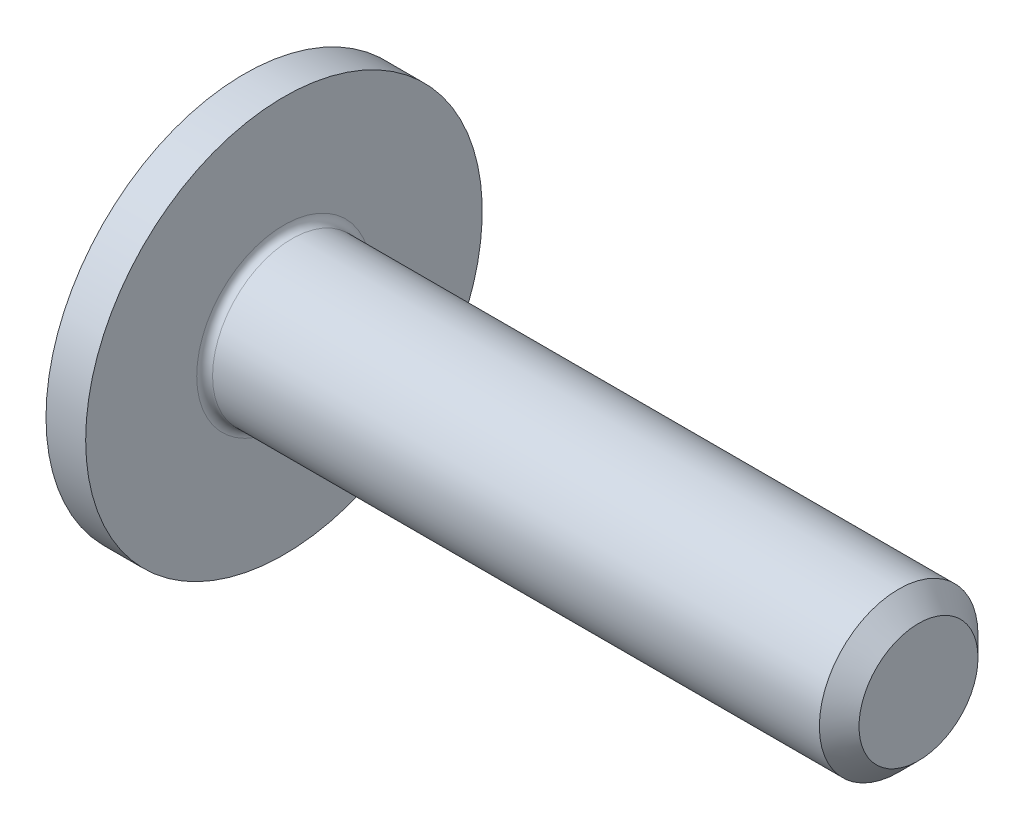
ISO-10303-21;
HEADER;
FILE_DESCRIPTION(('STEP AP214'),'2;1');
FILE_NAME('part.step','',(''),(''),'','','');
FILE_SCHEMA(('AUTOMOTIVE_DESIGN { 1 0 10303 214 1 1 1 1 }'));
ENDSEC;
DATA;
#1=APPLICATION_CONTEXT('core data for automotive mechanical design processes');
#2=APPLICATION_PROTOCOL_DEFINITION('international standard','automotive_design',2000,#1);
#3=PRODUCT_CONTEXT('',#1,'mechanical');
#4=PRODUCT('Part','Part','',(#3));
#5=PRODUCT_RELATED_PRODUCT_CATEGORY('part','',(#4));
#6=PRODUCT_DEFINITION_FORMATION('','',#4);
#7=PRODUCT_DEFINITION_CONTEXT('part definition',#1,'design');
#8=PRODUCT_DEFINITION('design','',#6,#7);
#9=PRODUCT_DEFINITION_SHAPE('','',#8);
#10=(LENGTH_UNIT() NAMED_UNIT(*) SI_UNIT(.MILLI.,.METRE.));
#11=(NAMED_UNIT(*) PLANE_ANGLE_UNIT() SI_UNIT($,.RADIAN.));
#12=(NAMED_UNIT(*) SI_UNIT($,.STERADIAN.) SOLID_ANGLE_UNIT());
#13=UNCERTAINTY_MEASURE_WITH_UNIT(LENGTH_MEASURE(1.E-05),#10,'distance_accuracy_value','');
#14=(GEOMETRIC_REPRESENTATION_CONTEXT(3) GLOBAL_UNCERTAINTY_ASSIGNED_CONTEXT((#13)) GLOBAL_UNIT_ASSIGNED_CONTEXT((#10,
#11,#12)) REPRESENTATION_CONTEXT('',''));
#15=CARTESIAN_POINT('',(0.,0.,0.));
#16=DIRECTION('',(0.,0.,1.));
#17=DIRECTION('',(1.,0.,0.));
#18=AXIS2_PLACEMENT_3D('',#15,#16,#17);
#19=CARTESIAN_POINT('',(5.8,0.,0.));
#20=DIRECTION('',(-1.,0.,0.));
#21=DIRECTION('',(0.,1.,0.));
#22=AXIS2_PLACEMENT_3D('',#19,#20,#21);
#23=SPHERICAL_SURFACE('',#22,5.8);
#24=CARTESIAN_POINT('',(2.05,0.,0.));
#25=DIRECTION('',(1.,0.,0.));
#26=DIRECTION('',(0.,0.,-1.));
#27=AXIS2_PLACEMENT_3D('',#24,#25,#26);
#28=CIRCLE('',#27,4.42464687856557);
#29=CARTESIAN_POINT('',(2.05,0.,-4.42464687856557));
#30=VERTEX_POINT('',#29);
#31=EDGE_CURVE('E423',#30,#30,#28,.F.);
#32=ORIENTED_EDGE('',*,*,#31,.T.);
#33=EDGE_LOOP('',(#32));
#34=FACE_BOUND('',#33,.T.);
#35=CARTESIAN_POINT('',(4.49544161532536,1.48681053180461,1.70147353185102));
#36=DIRECTION('',(0.5,-0.56985204697275,-0.652126248943383));
#37=DIRECTION('',(0.,0.753010530746166,-0.658008465435953));
#38=AXIS2_PLACEMENT_3D('',#35,#36,#37);
#39=CIRCLE('',#38,5.18001058723826);
#40=CARTESIAN_POINT('',(0.350670800180913,1.40442359564326,-1.40442359564326));
#41=VERTEX_POINT('',#40);
#42=CARTESIAN_POINT('',(0.0915426130173634,0.556694252642318,-0.862325791147634));
#43=VERTEX_POINT('',#42);
#44=EDGE_CURVE('E251',#41,#43,#39,.F.);
#45=ORIENTED_EDGE('',*,*,#44,.F.);
#46=CARTESIAN_POINT('',(4.49544161532536,-1.70147353185102,-1.48681053180461));
#47=DIRECTION('',(0.5,0.652126248943383,0.569852046972749));
#48=DIRECTION('',(0.,-0.658008465435952,0.753010530746167));
#49=AXIS2_PLACEMENT_3D('',#46,#47,#48);
#50=CIRCLE('',#49,5.18001058723826);
#51=CARTESIAN_POINT('',(0.0915426130173635,0.862325791147634,-0.556694252642318));
#52=VERTEX_POINT('',#51);
#53=EDGE_CURVE('E247',#52,#41,#50,.F.);
#54=ORIENTED_EDGE('',*,*,#53,.F.);
#55=CARTESIAN_POINT('',(0.0915426130173634,0.,0.));
#56=DIRECTION('',(1.,0.,0.));
#57=DIRECTION('',(0.,0.,-1.));
#58=AXIS2_PLACEMENT_3D('',#55,#56,#57);
#59=CIRCLE('',#58,1.02640842796783);
#60=CARTESIAN_POINT('',(0.0915426130173482,0.891122758840145,-0.509327487654908));
#61=VERTEX_POINT('',#60);
#62=EDGE_CURVE('E244',#61,#52,#59,.F.);
#63=ORIENTED_EDGE('',*,*,#62,.F.);
#64=CARTESIAN_POINT('',(5.80960489391217,0.,-0.155003115548178));
#65=DIRECTION('',(0.0618471864963983,0.,-0.998085630355672));
#66=DIRECTION('',(-0.998085630355672,0.,-0.0618471864963983));
#67=AXIS2_PLACEMENT_3D('',#64,#65,#66);
#68=CIRCLE('',#67,5.79792047032238);
#69=CARTESIAN_POINT('',(0.390286169611535,2.03324772703929,-0.490815600600995));
#70=VERTEX_POINT('',#69);
#71=EDGE_CURVE('E436',#61,#70,#68,.T.);
#72=ORIENTED_EDGE('',*,*,#71,.T.);
#73=CARTESIAN_POINT('',(5.91393656966608,0.380873675740912,0.));
#74=DIRECTION('',(0.286596561114573,0.958051361440137,0.));
#75=DIRECTION('',(-0.958051361440137,0.286596561114573,0.));
#76=AXIS2_PLACEMENT_3D('',#73,#74,#75);
#77=CIRCLE('',#76,5.78635927861555);
#78=CARTESIAN_POINT('',(0.390286169611535,2.03324772703929,0.490815600600995));
#79=VERTEX_POINT('',#78);
#80=EDGE_CURVE('E433',#70,#79,#77,.T.);
#81=ORIENTED_EDGE('',*,*,#80,.T.);
#82=CARTESIAN_POINT('',(5.80960489391217,0.,0.155003115548176));
#83=DIRECTION('',(0.0618471864963987,0.,0.998085630355672));
#84=DIRECTION('',(0.998085630355672,0.,-0.0618471864963988));
#85=AXIS2_PLACEMENT_3D('',#82,#83,#84);
#86=CIRCLE('',#85,5.79792047032238);
#87=CARTESIAN_POINT('',(0.091542613017363,0.891122758839946,0.509327487654907));
#88=VERTEX_POINT('',#87);
#89=EDGE_CURVE('E441',#79,#88,#86,.T.);
#90=ORIENTED_EDGE('',*,*,#89,.T.);
#91=CARTESIAN_POINT('',(0.0915426130173635,0.862325791147634,0.556694252642319));
#92=VERTEX_POINT('',#91);
#93=EDGE_CURVE('E266',#92,#88,#59,.F.);
#94=ORIENTED_EDGE('',*,*,#93,.F.);
#95=CARTESIAN_POINT('',(4.49544161532536,-1.70147353185102,1.48681053180461));
#96=DIRECTION('',(0.5,0.652126248943383,-0.569852046972749));
#97=DIRECTION('',(0.,0.658008465435952,0.753010530746167));
#98=AXIS2_PLACEMENT_3D('',#95,#96,#97);
#99=CIRCLE('',#98,5.18001058723826);
#100=CARTESIAN_POINT('',(0.350670800180913,1.40442359564326,1.40442359564326));
#101=VERTEX_POINT('',#100);
#102=EDGE_CURVE('E252',#101,#92,#99,.F.);
#103=ORIENTED_EDGE('',*,*,#102,.F.);
#104=CARTESIAN_POINT('',(4.49544161532536,1.48681053180461,-1.70147353185102));
#105=DIRECTION('',(0.5,-0.56985204697275,0.652126248943383));
#106=DIRECTION('',(0.,-0.753010530746166,-0.658008465435953));
#107=AXIS2_PLACEMENT_3D('',#104,#105,#106);
#108=CIRCLE('',#107,5.18001058723826);
#109=CARTESIAN_POINT('',(0.0915426130173634,0.556694252642318,0.862325791147634));
#110=VERTEX_POINT('',#109);
#111=EDGE_CURVE('E255',#110,#101,#108,.F.);
#112=ORIENTED_EDGE('',*,*,#111,.F.);
#113=CARTESIAN_POINT('',(0.0915426130173482,0.509327487654905,0.891122758840146));
#114=VERTEX_POINT('',#113);
#115=EDGE_CURVE('E269',#114,#110,#59,.F.);
#116=ORIENTED_EDGE('',*,*,#115,.F.);
#117=CARTESIAN_POINT('',(5.80960489391217,0.155003115548178,0.));
#118=DIRECTION('',(0.0618471864963983,0.998085630355672,0.));
#119=DIRECTION('',(-0.998085630355672,0.0618471864963983,0.));
#120=AXIS2_PLACEMENT_3D('',#117,#118,#119);
#121=CIRCLE('',#120,5.79792047032238);
#122=CARTESIAN_POINT('',(0.390286169611535,0.490815600600988,2.03324772703929));
#123=VERTEX_POINT('',#122);
#124=EDGE_CURVE('E578',#114,#123,#121,.T.);
#125=ORIENTED_EDGE('',*,*,#124,.T.);
#126=CARTESIAN_POINT('',(5.91393656966608,0.,0.380873675740912));
#127=DIRECTION('',(0.286596561114573,0.,0.958051361440137));
#128=DIRECTION('',(0.958051361440137,0.,-0.286596561114573));
#129=AXIS2_PLACEMENT_3D('',#126,#127,#128);
#130=CIRCLE('',#129,5.78635927861555);
#131=CARTESIAN_POINT('',(0.390286169611535,-0.490815600601002,2.03324772703929));
#132=VERTEX_POINT('',#131);
#133=EDGE_CURVE('E447',#123,#132,#130,.T.);
#134=ORIENTED_EDGE('',*,*,#133,.T.);
#135=CARTESIAN_POINT('',(5.80960489391217,-0.155003115548176,0.));
#136=DIRECTION('',(0.0618471864963987,-0.998085630355672,0.));
#137=DIRECTION('',(0.998085630355672,0.0618471864963988,0.));
#138=AXIS2_PLACEMENT_3D('',#135,#136,#137);
#139=CIRCLE('',#138,5.79792047032238);
#140=CARTESIAN_POINT('',(0.0915426130173487,-0.509327487654911,0.891122758840143));
#141=VERTEX_POINT('',#140);
#142=EDGE_CURVE('E577',#132,#141,#139,.T.);
#143=ORIENTED_EDGE('',*,*,#142,.T.);
#144=CARTESIAN_POINT('',(0.0915426130173634,-0.556694252642318,0.862325791147634));
#145=VERTEX_POINT('',#144);
#146=EDGE_CURVE('E615',#145,#141,#59,.F.);
#147=ORIENTED_EDGE('',*,*,#146,.F.);
#148=CARTESIAN_POINT('',(4.49544161532536,-1.48681053180461,-1.70147353185102));
#149=DIRECTION('',(0.5,0.56985204697275,0.652126248943383));
#150=DIRECTION('',(0.,-0.753010530746166,0.658008465435953));
#151=AXIS2_PLACEMENT_3D('',#148,#149,#150);
#152=CIRCLE('',#151,5.18001058723826);
#153=CARTESIAN_POINT('',(0.350670800180913,-1.40442359564326,1.40442359564326));
#154=VERTEX_POINT('',#153);
#155=EDGE_CURVE('E648',#154,#145,#152,.F.);
#156=ORIENTED_EDGE('',*,*,#155,.F.);
#157=CARTESIAN_POINT('',(4.49544161532536,1.70147353185102,1.48681053180461));
#158=DIRECTION('',(0.5,-0.652126248943383,-0.569852046972749));
#159=DIRECTION('',(0.,0.658008465435952,-0.753010530746167));
#160=AXIS2_PLACEMENT_3D('',#157,#158,#159);
#161=CIRCLE('',#160,5.18001058723826);
#162=CARTESIAN_POINT('',(0.0915426130173635,-0.862325791147634,0.556694252642318));
#163=VERTEX_POINT('',#162);
#164=EDGE_CURVE('E657',#163,#154,#161,.F.);
#165=ORIENTED_EDGE('',*,*,#164,.F.);
#166=CARTESIAN_POINT('',(0.091542613017363,-0.891122758839946,0.509327487654907));
#167=VERTEX_POINT('',#166);
#168=EDGE_CURVE('E274',#167,#163,#59,.F.);
#169=ORIENTED_EDGE('',*,*,#168,.F.);
#170=CARTESIAN_POINT('',(0.390286169611531,-2.03324772703928,0.490815600600995));
#171=VERTEX_POINT('',#170);
#172=EDGE_CURVE('E440',#167,#171,#86,.T.);
#173=ORIENTED_EDGE('',*,*,#172,.T.);
#174=CARTESIAN_POINT('',(5.91393656966608,-0.380873675740917,0.));
#175=DIRECTION('',(0.28659656111457,-0.958051361440138,0.));
#176=DIRECTION('',(0.958051361440138,0.28659656111457,0.));
#177=AXIS2_PLACEMENT_3D('',#174,#175,#176);
#178=CIRCLE('',#177,5.78635927861555);
#179=CARTESIAN_POINT('',(0.390286169611531,-2.03324772703928,-0.490815600600995));
#180=VERTEX_POINT('',#179);
#181=EDGE_CURVE('E444',#171,#180,#178,.T.);
#182=ORIENTED_EDGE('',*,*,#181,.T.);
#183=CARTESIAN_POINT('',(0.0915426130173481,-0.891122758840144,-0.509327487654908));
#184=VERTEX_POINT('',#183);
#185=EDGE_CURVE('E437',#180,#184,#68,.T.);
#186=ORIENTED_EDGE('',*,*,#185,.T.);
#187=CARTESIAN_POINT('',(0.0915426130173635,-0.862325791147634,-0.556694252642319));
#188=VERTEX_POINT('',#187);
#189=EDGE_CURVE('E614',#188,#184,#59,.F.);
#190=ORIENTED_EDGE('',*,*,#189,.F.);
#191=CARTESIAN_POINT('',(4.49544161532536,1.70147353185102,-1.48681053180461));
#192=DIRECTION('',(0.5,-0.652126248943383,0.569852046972749));
#193=DIRECTION('',(0.,-0.658008465435952,-0.753010530746167));
#194=AXIS2_PLACEMENT_3D('',#191,#192,#193);
#195=CIRCLE('',#194,5.18001058723826);
#196=CARTESIAN_POINT('',(0.350670800180912,-1.40442359564326,-1.40442359564326));
#197=VERTEX_POINT('',#196);
#198=EDGE_CURVE('E209',#197,#188,#195,.F.);
#199=ORIENTED_EDGE('',*,*,#198,.F.);
#200=CARTESIAN_POINT('',(4.49544161532536,-1.48681053180461,1.70147353185102));
#201=DIRECTION('',(0.5,0.56985204697275,-0.652126248943383));
#202=DIRECTION('',(0.,0.753010530746166,0.658008465435953));
#203=AXIS2_PLACEMENT_3D('',#200,#201,#202);
#204=CIRCLE('',#203,5.18001058723826);
#205=CARTESIAN_POINT('',(0.0915426130173634,-0.556694252642318,-0.862325791147634));
#206=VERTEX_POINT('',#205);
#207=EDGE_CURVE('E219',#206,#197,#204,.F.);
#208=ORIENTED_EDGE('',*,*,#207,.F.);
#209=CARTESIAN_POINT('',(0.0915426130173629,-0.509327487654904,-0.891122758839948));
#210=VERTEX_POINT('',#209);
#211=EDGE_CURVE('E226',#210,#206,#59,.F.);
#212=ORIENTED_EDGE('',*,*,#211,.F.);
#213=CARTESIAN_POINT('',(0.390286169611531,-0.490815600600988,-2.03324772703928));
#214=VERTEX_POINT('',#213);
#215=EDGE_CURVE('E575',#210,#214,#139,.T.);
#216=ORIENTED_EDGE('',*,*,#215,.T.);
#217=CARTESIAN_POINT('',(5.91393656966608,0.,-0.380873675740917));
#218=DIRECTION('',(0.28659656111457,0.,-0.958051361440138));
#219=DIRECTION('',(-0.958051361440138,0.,-0.28659656111457));
#220=AXIS2_PLACEMENT_3D('',#217,#218,#219);
#221=CIRCLE('',#220,5.78635927861555);
#222=CARTESIAN_POINT('',(0.390286169611531,0.490815600601002,-2.03324772703928));
#223=VERTEX_POINT('',#222);
#224=EDGE_CURVE('E449',#214,#223,#221,.T.);
#225=ORIENTED_EDGE('',*,*,#224,.T.);
#226=CARTESIAN_POINT('',(0.0915426130173631,0.50932748765491,-0.891122758839945));
#227=VERTEX_POINT('',#226);
#228=EDGE_CURVE('E579',#223,#227,#121,.T.);
#229=ORIENTED_EDGE('',*,*,#228,.T.);
#230=EDGE_CURVE('E273',#43,#227,#59,.F.);
#231=ORIENTED_EDGE('',*,*,#230,.F.);
#232=EDGE_LOOP('',(#45,#54,#63,#72,#81,#90,#94,#103,#112,#116,#125,#134,#143,#147,#156,#165,
#169,#173,#182,#186,#190,#199,#208,#212,#216,#225,#229,#231));
#233=FACE_BOUND('',#232,.T.);
#234=ADVANCED_FACE('F40',(#34,#233),#23,.T.);
#235=CARTESIAN_POINT('',(2.6,0.,0.));
#236=DIRECTION('',(-1.,0.,0.));
#237=DIRECTION('',(0.,0.,1.));
#238=AXIS2_PLACEMENT_3D('',#235,#236,#237);
#239=CONICAL_SURFACE('',#238,0.850999999999999,0.069813170079766);
#240=CARTESIAN_POINT('',(2.6,0.,0.));
#241=DIRECTION('',(-1.,0.,0.));
#242=DIRECTION('',(0.,0.,1.));
#243=AXIS2_PLACEMENT_3D('',#240,#241,#242);
#244=CIRCLE('',#243,0.850999999999999);
#245=CARTESIAN_POINT('',(2.6,0.,0.850999999999999));
#246=VERTEX_POINT('',#245);
#247=EDGE_CURVE('E260',#246,#246,#244,.T.);
#248=ORIENTED_EDGE('',*,*,#247,.F.);
#249=EDGE_LOOP('',(#248));
#250=FACE_BOUND('',#249,.T.);
#251=CARTESIAN_POINT('',(0.370538725217987,0.0918314341366156,0.0802457051897273));
#252=DIRECTION('',(0.5,0.652126248943383,0.569852046972749));
#253=DIRECTION('',(-0.866025403784438,0.376505265373084,0.329004232717976));
#254=AXIS2_PLACEMENT_3D('',#251,#252,#253);
#255=ELLIPSE('',#254,2.01379823859401,0.999486593679023);
#256=CARTESIAN_POINT('',(0.465382099864509,0.707295596002862,-0.707295596002862));
#257=VERTEX_POINT('',#256);
#258=EDGE_CURVE('E48',#52,#257,#255,.F.);
#259=ORIENTED_EDGE('',*,*,#258,.T.);
#260=CARTESIAN_POINT('',(0.370538725217985,-0.0802457051897277,-0.0918314341366157));
#261=DIRECTION('',(0.5,-0.56985204697275,-0.652126248943383));
#262=DIRECTION('',(-0.866025403784438,-0.329004232717977,-0.376505265373083));
#263=AXIS2_PLACEMENT_3D('',#260,#261,#262);
#264=ELLIPSE('',#263,2.01379823859401,0.999486593679024);
#265=EDGE_CURVE('E11',#257,#43,#264,.F.);
#266=ORIENTED_EDGE('',*,*,#265,.T.);
#267=ORIENTED_EDGE('',*,*,#230,.T.);
#268=CARTESIAN_POINT('',(0.0452078804564265,0.512198656980268,-0.893212462768129));
#269=CARTESIAN_POINT('',(0.365106160426383,0.492375900315463,-0.878790183729411));
#270=CARTESIAN_POINT('',(0.684997245175192,0.472553589508378,-0.864205051965348));
#271=CARTESIAN_POINT('',(1.32476098967625,0.432910109614082,-0.834642123898892));
#272=CARTESIAN_POINT('',(1.64463364944747,0.413088940525694,-0.819664328008124));
#273=CARTESIAN_POINT('',(2.08973198362717,0.385508060843619,-0.798502412906335));
#274=CARTESIAN_POINT('',(2.2149668823717,0.377747778656458,-0.792512888403489));
#275=CARTESIAN_POINT('',(2.3402,0.36998760683761,-0.786486121868666));
#276=B_SPLINE_CURVE_WITH_KNOTS('',3,(#268,#269,#270,#271,#272,#273,#274,#275),.UNSPECIFIED.,.F.,
.F.,(4,2,2,4),(0.,0.962508687501757,1.92501636605824,2.30187028300653),.UNSPECIFIED.);
#277=CARTESIAN_POINT('',(2.34,0.370000000000003,-0.786495747306727));
#278=VERTEX_POINT('',#277);
#279=EDGE_CURVE('E336',#227,#278,#276,.T.);
#280=ORIENTED_EDGE('',*,*,#279,.T.);
#281=CARTESIAN_POINT('',(2.34,0.,0.));
#282=DIRECTION('',(-1.,0.,0.));
#283=DIRECTION('',(0.,0.,1.));
#284=AXIS2_PLACEMENT_3D('',#281,#282,#283);
#285=CIRCLE('',#284,0.86918097110531);
#286=CARTESIAN_POINT('',(2.34,-0.369999999999997,-0.78649574730673));
#287=VERTEX_POINT('',#286);
#288=EDGE_CURVE('E267',#287,#278,#285,.F.);
#289=ORIENTED_EDGE('',*,*,#288,.F.);
#290=CARTESIAN_POINT('',(2.3402,-0.369987606837604,-0.786486121868669));
#291=CARTESIAN_POINT('',(2.07019913746138,-0.386718429516279,-0.799478554072587));
#292=CARTESIAN_POINT('',(1.80019009427807,-0.403449759115245,-0.812299140431048));
#293=CARTESIAN_POINT('',(1.26015794483742,-0.436913289742977,-0.837635105994263));
#294=CARTESIAN_POINT('',(0.990134838591079,-0.453645490771063,-0.850150485434047));
#295=CARTESIAN_POINT('',(0.495143747104779,-0.484318015670855,-0.872848007294731));
#296=CARTESIAN_POINT('',(0.270177625154038,-0.498258224082332,-0.883070947346797));
#297=CARTESIAN_POINT('',(0.0452078804564257,-0.512198656980261,-0.893212462768132));
#298=B_SPLINE_CURVE_WITH_KNOTS('',3,(#290,#291,#292,#293,#294,#295,#296,#297),.UNSPECIFIED.,.F.,
.F.,(4,2,2,4),(0.,0.812491523202115,1.62498242071296,2.30187030608887),.UNSPECIFIED.);
#299=EDGE_CURVE('E341',#287,#210,#298,.T.);
#300=ORIENTED_EDGE('',*,*,#299,.T.);
#301=ORIENTED_EDGE('',*,*,#211,.T.);
#302=CARTESIAN_POINT('',(0.370538725217985,0.0802457051897277,-0.0918314341366157));
#303=DIRECTION('',(0.5,0.56985204697275,-0.652126248943383));
#304=DIRECTION('',(-0.866025403784438,0.329004232717977,-0.376505265373083));
#305=AXIS2_PLACEMENT_3D('',#302,#303,#304);
#306=ELLIPSE('',#305,2.01379823859401,0.999486593679024);
#307=CARTESIAN_POINT('',(0.465382099864508,-0.707295596002862,-0.707295596002861));
#308=VERTEX_POINT('',#307);
#309=EDGE_CURVE('E213',#206,#308,#306,.F.);
#310=ORIENTED_EDGE('',*,*,#309,.T.);
#311=CARTESIAN_POINT('',(0.370538725217986,-0.0918314341366154,0.0802457051897273));
#312=DIRECTION('',(0.5,-0.652126248943383,0.569852046972749));
#313=DIRECTION('',(-0.866025403784438,-0.376505265373084,0.329004232717976));
#314=AXIS2_PLACEMENT_3D('',#311,#312,#313);
#315=ELLIPSE('',#314,2.01379823859401,0.999486593679023);
#316=EDGE_CURVE('E204',#308,#188,#315,.F.);
#317=ORIENTED_EDGE('',*,*,#316,.T.);
#318=ORIENTED_EDGE('',*,*,#189,.T.);
#319=CARTESIAN_POINT('',(0.0452078804564257,-0.89321246276813,-0.512198656980264));
#320=CARTESIAN_POINT('',(0.365106160426382,-0.878790183729412,-0.492375900315459));
#321=CARTESIAN_POINT('',(0.684997245175191,-0.864205051965349,-0.472553589508375));
#322=CARTESIAN_POINT('',(1.32476098967625,-0.834642123898894,-0.432910109614079));
#323=CARTESIAN_POINT('',(1.64463364944747,-0.819664328008126,-0.413088940525692));
#324=CARTESIAN_POINT('',(2.08973198362717,-0.798502412906337,-0.385508060843616));
#325=CARTESIAN_POINT('',(2.2149668823717,-0.792512888403491,-0.377747778656455));
#326=CARTESIAN_POINT('',(2.3402,-0.786486121868667,-0.369987606837608));
#327=B_SPLINE_CURVE_WITH_KNOTS('',3,(#319,#320,#321,#322,#323,#324,#325,#326),.UNSPECIFIED.,.F.,
.F.,(4,2,2,4),(0.,0.962508687501757,1.92501636605824,2.30187028300653),.UNSPECIFIED.);
#328=CARTESIAN_POINT('',(2.34,-0.786495747306728,-0.370000000000001));
#329=VERTEX_POINT('',#328);
#330=EDGE_CURVE('E330',#184,#329,#327,.T.);
#331=ORIENTED_EDGE('',*,*,#330,.T.);
#332=CARTESIAN_POINT('',(2.34,-0.786495747306729,0.37));
#333=VERTEX_POINT('',#332);
#334=EDGE_CURVE('E675',#333,#329,#285,.F.);
#335=ORIENTED_EDGE('',*,*,#334,.F.);
#336=CARTESIAN_POINT('',(2.3402,-0.786486121868668,0.369987606837607));
#337=CARTESIAN_POINT('',(2.07019913746138,-0.799478554072585,0.386718429516281));
#338=CARTESIAN_POINT('',(1.80019009427807,-0.812299140431046,0.403449759115247));
#339=CARTESIAN_POINT('',(1.26015794483742,-0.837635105994262,0.43691328974298));
#340=CARTESIAN_POINT('',(0.990134838591079,-0.850150485434045,0.453645490771066));
#341=CARTESIAN_POINT('',(0.495143747104779,-0.872848007294729,0.484318015670858));
#342=CARTESIAN_POINT('',(0.270177625154038,-0.883070947346795,0.498258224082335));
#343=CARTESIAN_POINT('',(0.0452078804564257,-0.89321246276813,0.512198656980265));
#344=B_SPLINE_CURVE_WITH_KNOTS('',3,(#336,#337,#338,#339,#340,#341,#342,#343),.UNSPECIFIED.,.F.,
.F.,(4,2,2,4),(0.,0.812491523202115,1.62498242071296,2.30187030608887),.UNSPECIFIED.);
#345=EDGE_CURVE('E316',#333,#167,#344,.T.);
#346=ORIENTED_EDGE('',*,*,#345,.T.);
#347=ORIENTED_EDGE('',*,*,#168,.T.);
#348=CARTESIAN_POINT('',(0.370538725217987,-0.0918314341366156,-0.0802457051897273));
#349=DIRECTION('',(0.5,-0.652126248943383,-0.569852046972749));
#350=DIRECTION('',(-0.866025403784438,-0.376505265373084,-0.329004232717976));
#351=AXIS2_PLACEMENT_3D('',#348,#349,#350);
#352=ELLIPSE('',#351,2.01379823859401,0.999486593679023);
#353=CARTESIAN_POINT('',(0.465382099864509,-0.707295596002862,0.707295596002862));
#354=VERTEX_POINT('',#353);
#355=EDGE_CURVE('E227',#163,#354,#352,.F.);
#356=ORIENTED_EDGE('',*,*,#355,.T.);
#357=CARTESIAN_POINT('',(0.370538725217985,0.0802457051897277,0.0918314341366157));
#358=DIRECTION('',(0.5,0.56985204697275,0.652126248943383));
#359=DIRECTION('',(-0.866025403784438,0.329004232717977,0.376505265373083));
#360=AXIS2_PLACEMENT_3D('',#357,#358,#359);
#361=ELLIPSE('',#360,2.01379823859401,0.999486593679024);
#362=EDGE_CURVE('E230',#354,#145,#361,.F.);
#363=ORIENTED_EDGE('',*,*,#362,.T.);
#364=ORIENTED_EDGE('',*,*,#146,.T.);
#365=CARTESIAN_POINT('',(0.0452078804564256,-0.512198656980268,0.893212462768128));
#366=CARTESIAN_POINT('',(0.365106160426382,-0.492375900315462,0.878790183729411));
#367=CARTESIAN_POINT('',(0.684997245175191,-0.472553589508378,0.864205051965348));
#368=CARTESIAN_POINT('',(1.32476098967625,-0.432910109614081,0.834642123898892));
#369=CARTESIAN_POINT('',(1.64463364944747,-0.413088940525694,0.819664328008125));
#370=CARTESIAN_POINT('',(2.08973198362717,-0.385508060843618,0.798502412906336));
#371=CARTESIAN_POINT('',(2.2149668823717,-0.377747778656457,0.79251288840349));
#372=CARTESIAN_POINT('',(2.3402,-0.36998760683761,0.786486121868666));
#373=B_SPLINE_CURVE_WITH_KNOTS('',3,(#365,#366,#367,#368,#369,#370,#371,#372),.UNSPECIFIED.,.F.,
.F.,(4,2,2,4),(0.,0.962508687501757,1.92501636605824,2.30187028300653),.UNSPECIFIED.);
#374=CARTESIAN_POINT('',(2.34,-0.370000000000002,0.786495747306728));
#375=VERTEX_POINT('',#374);
#376=EDGE_CURVE('E272',#141,#375,#373,.T.);
#377=ORIENTED_EDGE('',*,*,#376,.T.);
#378=CARTESIAN_POINT('',(2.34,0.369999999999998,0.78649574730673));
#379=VERTEX_POINT('',#378);
#380=EDGE_CURVE('E263',#379,#375,#285,.F.);
#381=ORIENTED_EDGE('',*,*,#380,.F.);
#382=CARTESIAN_POINT('',(2.3402,0.369987606837605,0.786486121868669));
#383=CARTESIAN_POINT('',(2.07019913746138,0.386718429516279,0.799478554072586));
#384=CARTESIAN_POINT('',(1.80019009427807,0.403449759115245,0.812299140431047));
#385=CARTESIAN_POINT('',(1.26015794483742,0.436913289742977,0.837635105994263));
#386=CARTESIAN_POINT('',(0.990134838591079,0.453645490771063,0.850150485434047));
#387=CARTESIAN_POINT('',(0.495143747104779,0.484318015670855,0.87284800729473));
#388=CARTESIAN_POINT('',(0.270177625154038,0.498258224082332,0.883070947346796));
#389=CARTESIAN_POINT('',(0.0452078804564257,0.512198656980261,0.893212462768132));
#390=B_SPLINE_CURVE_WITH_KNOTS('',3,(#382,#383,#384,#385,#386,#387,#388,#389),.UNSPECIFIED.,.F.,
.F.,(4,2,2,4),(0.,0.812491523202115,1.62498242071296,2.30187030608887),.UNSPECIFIED.);
#391=EDGE_CURVE('E304',#379,#114,#390,.T.);
#392=ORIENTED_EDGE('',*,*,#391,.T.);
#393=ORIENTED_EDGE('',*,*,#115,.T.);
#394=CARTESIAN_POINT('',(0.370538725217985,-0.0802457051897277,0.0918314341366157));
#395=DIRECTION('',(0.5,-0.56985204697275,0.652126248943383));
#396=DIRECTION('',(-0.866025403784438,-0.329004232717977,0.376505265373083));
#397=AXIS2_PLACEMENT_3D('',#394,#395,#396);
#398=ELLIPSE('',#397,2.01379823859401,0.999486593679024);
#399=CARTESIAN_POINT('',(0.465382099864508,0.707295596002861,0.707295596002861));
#400=VERTEX_POINT('',#399);
#401=EDGE_CURVE('E236',#110,#400,#398,.F.);
#402=ORIENTED_EDGE('',*,*,#401,.T.);
#403=CARTESIAN_POINT('',(0.370538725217986,0.0918314341366154,-0.0802457051897273));
#404=DIRECTION('',(0.5,0.652126248943383,-0.569852046972749));
#405=DIRECTION('',(-0.866025403784438,0.376505265373084,-0.329004232717976));
#406=AXIS2_PLACEMENT_3D('',#403,#404,#405);
#407=ELLIPSE('',#406,2.01379823859401,0.999486593679023);
#408=EDGE_CURVE('E239',#400,#92,#407,.F.);
#409=ORIENTED_EDGE('',*,*,#408,.T.);
#410=ORIENTED_EDGE('',*,*,#93,.T.);
#411=CARTESIAN_POINT('',(0.0452078804564257,0.89321246276813,0.512198656980265));
#412=CARTESIAN_POINT('',(0.365106160426382,0.878790183729412,0.492375900315459));
#413=CARTESIAN_POINT('',(0.684997245175191,0.864205051965349,0.472553589508375));
#414=CARTESIAN_POINT('',(1.32476098967625,0.834642123898894,0.432910109614078));
#415=CARTESIAN_POINT('',(1.64463364944747,0.819664328008126,0.413088940525691));
#416=CARTESIAN_POINT('',(2.08973198362717,0.798502412906337,0.385508060843615));
#417=CARTESIAN_POINT('',(2.2149668823717,0.792512888403491,0.377747778656454));
#418=CARTESIAN_POINT('',(2.3402,0.786486121868668,0.369987606837607));
#419=B_SPLINE_CURVE_WITH_KNOTS('',3,(#411,#412,#413,#414,#415,#416,#417,#418),.UNSPECIFIED.,.F.,
.F.,(4,2,2,4),(0.,0.962508687501757,1.92501636605824,2.30187028300653),.UNSPECIFIED.);
#420=CARTESIAN_POINT('',(2.34,0.786495747306729,0.37));
#421=VERTEX_POINT('',#420);
#422=EDGE_CURVE('E282',#88,#421,#419,.T.);
#423=ORIENTED_EDGE('',*,*,#422,.T.);
#424=CARTESIAN_POINT('',(2.34,0.786495747306729,-0.370000000000001));
#425=VERTEX_POINT('',#424);
#426=EDGE_CURVE('E268',#425,#421,#285,.F.);
#427=ORIENTED_EDGE('',*,*,#426,.F.);
#428=CARTESIAN_POINT('',(2.3402,0.786486121868667,-0.369987606837607));
#429=CARTESIAN_POINT('',(2.07019913746138,0.799478554072585,-0.386718429516282));
#430=CARTESIAN_POINT('',(1.80019009427807,0.812299140431046,-0.403449759115248));
#431=CARTESIAN_POINT('',(1.26015794483742,0.837635105994261,-0.43691328974298));
#432=CARTESIAN_POINT('',(0.990134838591079,0.850150485434045,-0.453645490771066));
#433=CARTESIAN_POINT('',(0.495143747104779,0.872848007294729,-0.484318015670858));
#434=CARTESIAN_POINT('',(0.270177625154039,0.883070947346795,-0.498258224082335));
#435=CARTESIAN_POINT('',(0.0452078804564266,0.89321246276813,-0.512198656980264));
#436=B_SPLINE_CURVE_WITH_KNOTS('',3,(#428,#429,#430,#431,#432,#433,#434,#435),.UNSPECIFIED.,.F.,
.F.,(4,2,2,4),(0.,0.812491523202115,1.62498242071296,2.30187030608887),.UNSPECIFIED.);
#437=EDGE_CURVE('E323',#425,#61,#436,.T.);
#438=ORIENTED_EDGE('',*,*,#437,.T.);
#439=ORIENTED_EDGE('',*,*,#62,.T.);
#440=EDGE_LOOP('',(#259,#266,#267,#280,#289,#300,#301,#310,#317,#318,#331,#335,#346,#347,#356,
#363,#364,#377,#381,#392,#393,#402,#409,#410,#423,#427,#438,#439));
#441=FACE_BOUND('',#440,.T.);
#442=ADVANCED_FACE('F224',(#250,#441),#239,.F.);
#443=CARTESIAN_POINT('',(0.,-2.14999999999999,0.515));
#444=DIRECTION('',(0.0618471864963987,0.,0.998085630355672));
#445=DIRECTION('',(0.998085630355672,0.,-0.0618471864963988));
#446=AXIS2_PLACEMENT_3D('',#443,#444,#445);
#447=PLANE('',#446);
#448=ORIENTED_EDGE('',*,*,#345,.F.);
#449=DIRECTION('',(0.,1.,0.));
#450=VECTOR('',#449,1.);
#451=CARTESIAN_POINT('',(2.34,-1.45,0.37));
#452=LINE('',#451,#450);
#453=CARTESIAN_POINT('',(2.34,-1.45,0.37));
#454=VERTEX_POINT('',#453);
#455=EDGE_CURVE('E554',#454,#333,#452,.T.);
#456=ORIENTED_EDGE('',*,*,#455,.F.);
#457=DIRECTION('',(0.956367545721271,0.286092855557643,-0.0592620915083696));
#458=VECTOR('',#457,1.);
#459=CARTESIAN_POINT('',(0.,-2.14999999999999,0.515));
#460=LINE('',#459,#458);
#461=EDGE_CURVE('E548',#171,#454,#460,.T.);
#462=ORIENTED_EDGE('',*,*,#461,.F.);
#463=ORIENTED_EDGE('',*,*,#172,.F.);
#464=EDGE_LOOP('',(#448,#456,#462,#463));
#465=FACE_BOUND('',#464,.T.);
#466=ADVANCED_FACE('F296',(#465),#447,.F.);
#467=CARTESIAN_POINT('',(0.,2.15000000000001,-0.515));
#468=DIRECTION('',(0.0618471864963983,0.,-0.998085630355672));
#469=DIRECTION('',(-0.998085630355672,0.,-0.0618471864963983));
#470=AXIS2_PLACEMENT_3D('',#467,#468,#469);
#471=PLANE('',#470);
#472=ORIENTED_EDGE('',*,*,#330,.F.);
#473=ORIENTED_EDGE('',*,*,#185,.F.);
#474=DIRECTION('',(0.956367545721271,0.286092855557643,0.0592620915083691));
#475=VECTOR('',#474,1.);
#476=CARTESIAN_POINT('',(0.,-2.14999999999999,-0.515));
#477=LINE('',#476,#475);
#478=CARTESIAN_POINT('',(2.34,-1.45,-0.370000000000001));
#479=VERTEX_POINT('',#478);
#480=EDGE_CURVE('E551',#180,#479,#477,.T.);
#481=ORIENTED_EDGE('',*,*,#480,.T.);
#482=DIRECTION('',(0.,-1.,0.));
#483=VECTOR('',#482,1.);
#484=CARTESIAN_POINT('',(2.34,1.45,-0.37));
#485=LINE('',#484,#483);
#486=EDGE_CURVE('E566',#329,#479,#485,.T.);
#487=ORIENTED_EDGE('',*,*,#486,.F.);
#488=EDGE_LOOP('',(#472,#473,#481,#487));
#489=FACE_BOUND('',#488,.T.);
#490=ADVANCED_FACE('F366',(#489),#471,.F.);
#491=ORIENTED_EDGE('',*,*,#422,.F.);
#492=ORIENTED_EDGE('',*,*,#89,.F.);
#493=DIRECTION('',(0.95636754572127,-0.286092855557647,-0.0592620915083695));
#494=VECTOR('',#493,1.);
#495=CARTESIAN_POINT('',(0.,2.15000000000001,0.515));
#496=LINE('',#495,#494);
#497=CARTESIAN_POINT('',(2.34,1.45,0.37));
#498=VERTEX_POINT('',#497);
#499=EDGE_CURVE('E570',#79,#498,#496,.T.);
#500=ORIENTED_EDGE('',*,*,#499,.T.);
#501=EDGE_CURVE('E558',#421,#498,#452,.T.);
#502=ORIENTED_EDGE('',*,*,#501,.F.);
#503=EDGE_LOOP('',(#491,#492,#500,#502));
#504=FACE_BOUND('',#503,.T.);
#505=ADVANCED_FACE('F368',(#504),#447,.F.);
#506=ORIENTED_EDGE('',*,*,#437,.F.);
#507=CARTESIAN_POINT('',(2.34,1.45,-0.37));
#508=VERTEX_POINT('',#507);
#509=EDGE_CURVE('E563',#508,#425,#485,.T.);
#510=ORIENTED_EDGE('',*,*,#509,.F.);
#511=DIRECTION('',(0.95636754572127,-0.286092855557647,0.0592620915083691));
#512=VECTOR('',#511,1.);
#513=CARTESIAN_POINT('',(0.,2.15000000000001,-0.515));
#514=LINE('',#513,#512);
#515=EDGE_CURVE('E562',#70,#508,#514,.T.);
#516=ORIENTED_EDGE('',*,*,#515,.F.);
#517=ORIENTED_EDGE('',*,*,#71,.F.);
#518=EDGE_LOOP('',(#506,#510,#516,#517));
#519=FACE_BOUND('',#518,.T.);
#520=ADVANCED_FACE('F374',(#519),#471,.F.);
#521=CARTESIAN_POINT('',(2.34,1.45,0.37));
#522=DIRECTION('',(-1.,0.,0.));
#523=DIRECTION('',(0.,0.,1.));
#524=AXIS2_PLACEMENT_3D('',#521,#522,#523);
#525=PLANE('',#524);
#526=ORIENTED_EDGE('',*,*,#455,.T.);
#527=ORIENTED_EDGE('',*,*,#334,.T.);
#528=ORIENTED_EDGE('',*,*,#486,.T.);
#529=DIRECTION('',(0.,0.,1.));
#530=VECTOR('',#529,1.);
#531=CARTESIAN_POINT('',(2.34,-1.45,-0.370000000000001));
#532=LINE('',#531,#530);
#533=EDGE_CURVE('E559',#479,#454,#532,.T.);
#534=ORIENTED_EDGE('',*,*,#533,.T.);
#535=EDGE_LOOP('',(#526,#527,#528,#534));
#536=FACE_BOUND('',#535,.T.);
#537=ADVANCED_FACE('F383',(#536),#525,.T.);
#538=DIRECTION('',(0.,0.,1.));
#539=VECTOR('',#538,1.);
#540=CARTESIAN_POINT('',(2.34,-0.369999999999995,-1.45));
#541=LINE('',#540,#539);
#542=CARTESIAN_POINT('',(2.34,-0.369999999999995,-1.45));
#543=VERTEX_POINT('',#542);
#544=EDGE_CURVE('E582',#543,#287,#541,.T.);
#545=ORIENTED_EDGE('',*,*,#544,.T.);
#546=ORIENTED_EDGE('',*,*,#288,.T.);
#547=DIRECTION('',(0.,0.,-1.));
#548=VECTOR('',#547,1.);
#549=CARTESIAN_POINT('',(2.34,0.369999999999995,1.45000000000001));
#550=LINE('',#549,#548);
#551=CARTESIAN_POINT('',(2.34,0.370000000000006,-1.44999999999999));
#552=VERTEX_POINT('',#551);
#553=EDGE_CURVE('E594',#278,#552,#550,.T.);
#554=ORIENTED_EDGE('',*,*,#553,.T.);
#555=DIRECTION('',(0.,-1.,0.));
#556=VECTOR('',#555,1.);
#557=CARTESIAN_POINT('',(2.34,0.370000000000006,-1.44999999999999));
#558=LINE('',#557,#556);
#559=EDGE_CURVE('E587',#552,#543,#558,.T.);
#560=ORIENTED_EDGE('',*,*,#559,.T.);
#561=EDGE_LOOP('',(#545,#546,#554,#560));
#562=FACE_BOUND('',#561,.T.);
#563=ADVANCED_FACE('F610',(#562),#525,.T.);
#564=ORIENTED_EDGE('',*,*,#509,.T.);
#565=ORIENTED_EDGE('',*,*,#426,.T.);
#566=ORIENTED_EDGE('',*,*,#501,.T.);
#567=DIRECTION('',(0.,0.,-1.));
#568=VECTOR('',#567,1.);
#569=CARTESIAN_POINT('',(2.34,1.45,0.37));
#570=LINE('',#569,#568);
#571=EDGE_CURVE('E557',#498,#508,#570,.T.);
#572=ORIENTED_EDGE('',*,*,#571,.T.);
#573=EDGE_LOOP('',(#564,#565,#566,#572));
#574=FACE_BOUND('',#573,.T.);
#575=ADVANCED_FACE('F351',(#574),#525,.T.);
#576=CARTESIAN_POINT('',(0.,0.514999999999992,2.15000000000001));
#577=DIRECTION('',(0.0618471864963983,0.998085630355672,0.));
#578=DIRECTION('',(-0.998085630355672,0.0618471864963983,0.));
#579=AXIS2_PLACEMENT_3D('',#576,#577,#578);
#580=PLANE('',#579);
#581=ORIENTED_EDGE('',*,*,#279,.F.);
#582=ORIENTED_EDGE('',*,*,#228,.F.);
#583=DIRECTION('',(0.956367545721271,-0.0592620915083701,0.286092855557643));
#584=VECTOR('',#583,1.);
#585=CARTESIAN_POINT('',(0.,0.515000000000008,-2.14999999999999));
#586=LINE('',#585,#584);
#587=EDGE_CURVE('E601',#223,#552,#586,.T.);
#588=ORIENTED_EDGE('',*,*,#587,.T.);
#589=ORIENTED_EDGE('',*,*,#553,.F.);
#590=EDGE_LOOP('',(#581,#582,#588,#589));
#591=FACE_BOUND('',#590,.T.);
#592=ADVANCED_FACE('F347',(#591),#580,.F.);
#593=CARTESIAN_POINT('',(0.,-0.514999999999993,-2.14999999999999));
#594=DIRECTION('',(0.0618471864963987,-0.998085630355672,0.));
#595=DIRECTION('',(0.998085630355672,0.0618471864963988,0.));
#596=AXIS2_PLACEMENT_3D('',#593,#594,#595);
#597=PLANE('',#596);
#598=ORIENTED_EDGE('',*,*,#299,.F.);
#599=ORIENTED_EDGE('',*,*,#544,.F.);
#600=DIRECTION('',(0.956367545721271,0.0592620915083686,0.286092855557644));
#601=VECTOR('',#600,1.);
#602=CARTESIAN_POINT('',(0.,-0.514999999999993,-2.14999999999999));
#603=LINE('',#602,#601);
#604=EDGE_CURVE('E581',#214,#543,#603,.T.);
#605=ORIENTED_EDGE('',*,*,#604,.F.);
#606=ORIENTED_EDGE('',*,*,#215,.F.);
#607=EDGE_LOOP('',(#598,#599,#605,#606));
#608=FACE_BOUND('',#607,.T.);
#609=ADVANCED_FACE('F289',(#608),#597,.F.);
#610=ORIENTED_EDGE('',*,*,#376,.F.);
#611=ORIENTED_EDGE('',*,*,#142,.F.);
#612=DIRECTION('',(0.95636754572127,0.0592620915083705,-0.286092855557646));
#613=VECTOR('',#612,1.);
#614=CARTESIAN_POINT('',(0.,-0.515000000000008,2.15000000000001));
#615=LINE('',#614,#613);
#616=CARTESIAN_POINT('',(2.34,-0.370000000000005,1.45));
#617=VERTEX_POINT('',#616);
#618=EDGE_CURVE('E598',#132,#617,#615,.T.);
#619=ORIENTED_EDGE('',*,*,#618,.T.);
#620=EDGE_CURVE('E586',#375,#617,#541,.T.);
#621=ORIENTED_EDGE('',*,*,#620,.F.);
#622=EDGE_LOOP('',(#610,#611,#619,#621));
#623=FACE_BOUND('',#622,.T.);
#624=ADVANCED_FACE('F639',(#623),#597,.F.);
#625=ORIENTED_EDGE('',*,*,#391,.F.);
#626=CARTESIAN_POINT('',(2.34,0.369999999999995,1.45000000000001));
#627=VERTEX_POINT('',#626);
#628=EDGE_CURVE('E591',#627,#379,#550,.T.);
#629=ORIENTED_EDGE('',*,*,#628,.F.);
#630=DIRECTION('',(0.95636754572127,-0.0592620915083681,-0.286092855557647));
#631=VECTOR('',#630,1.);
#632=CARTESIAN_POINT('',(0.,0.514999999999992,2.15000000000001));
#633=LINE('',#632,#631);
#634=EDGE_CURVE('E590',#123,#627,#633,.T.);
#635=ORIENTED_EDGE('',*,*,#634,.F.);
#636=ORIENTED_EDGE('',*,*,#124,.F.);
#637=EDGE_LOOP('',(#625,#629,#635,#636));
#638=FACE_BOUND('',#637,.T.);
#639=ADVANCED_FACE('F353',(#638),#580,.F.);
#640=CARTESIAN_POINT('',(-6.34999999999999,0.,0.));
#641=DIRECTION('',(-1.,0.,0.));
#642=DIRECTION('',(0.,0.,1.));
#643=AXIS2_PLACEMENT_3D('',#640,#641,#642);
#644=CYLINDRICAL_SURFACE('',#643,2.00000000000001);
#645=CARTESIAN_POINT('',(18.55,0.,0.));
#646=DIRECTION('',(1.,0.,0.));
#647=DIRECTION('',(0.,0.,-1.));
#648=AXIS2_PLACEMENT_3D('',#645,#646,#647);
#649=CIRCLE('',#648,2.00000000000001);
#650=CARTESIAN_POINT('',(18.55,0.,-2.00000000000001));
#651=VERTEX_POINT('',#650);
#652=EDGE_CURVE('E453',#651,#651,#649,.F.);
#653=ORIENTED_EDGE('',*,*,#652,.T.);
#654=EDGE_LOOP('',(#653));
#655=FACE_BOUND('',#654,.T.);
#656=CARTESIAN_POINT('',(3.25,0.,0.));
#657=DIRECTION('',(-1.,0.,0.));
#658=DIRECTION('',(0.,0.,1.));
#659=AXIS2_PLACEMENT_3D('',#656,#657,#658);
#660=CIRCLE('',#659,2.00000000000001);
#661=CARTESIAN_POINT('',(3.25,0.,2.00000000000001));
#662=VERTEX_POINT('',#661);
#663=EDGE_CURVE('E413',#662,#662,#660,.F.);
#664=ORIENTED_EDGE('',*,*,#663,.T.);
#665=EDGE_LOOP('',(#664));
#666=FACE_BOUND('',#665,.T.);
#667=ADVANCED_FACE('F402',(#655,#666),#644,.T.);
#668=CARTESIAN_POINT('',(19.05,2.00000000000001,0.));
#669=DIRECTION('',(1.,0.,0.));
#670=DIRECTION('',(0.,0.,-1.));
#671=AXIS2_PLACEMENT_3D('',#668,#669,#670);
#672=PLANE('',#671);
#673=CARTESIAN_POINT('',(19.05,0.,0.));
#674=DIRECTION('',(1.,0.,0.));
#675=DIRECTION('',(0.,0.,-1.));
#676=AXIS2_PLACEMENT_3D('',#673,#674,#675);
#677=CIRCLE('',#676,1.5);
#678=CARTESIAN_POINT('',(19.05,0.,-1.5));
#679=VERTEX_POINT('',#678);
#680=EDGE_CURVE('E214',#679,#679,#677,.T.);
#681=ORIENTED_EDGE('',*,*,#680,.T.);
#682=EDGE_LOOP('',(#681));
#683=FACE_BOUND('',#682,.T.);
#684=ADVANCED_FACE('F398',(#683),#672,.T.);
#685=CARTESIAN_POINT('',(2.05,5.,0.));
#686=DIRECTION('',(1.,0.,0.));
#687=DIRECTION('',(0.,0.,-1.));
#688=AXIS2_PLACEMENT_3D('',#685,#686,#687);
#689=PLANE('',#688);
#690=ORIENTED_EDGE('',*,*,#31,.F.);
#691=EDGE_LOOP('',(#690));
#692=FACE_BOUND('',#691,.T.);
#693=CARTESIAN_POINT('',(2.05,0.,0.));
#694=DIRECTION('',(-1.,0.,0.));
#695=DIRECTION('',(0.,0.,1.));
#696=AXIS2_PLACEMENT_3D('',#693,#694,#695);
#697=CIRCLE('',#696,5.);
#698=CARTESIAN_POINT('',(2.05,0.,5.));
#699=VERTEX_POINT('',#698);
#700=EDGE_CURVE('E418',#699,#699,#697,.T.);
#701=ORIENTED_EDGE('',*,*,#700,.T.);
#702=EDGE_LOOP('',(#701));
#703=FACE_BOUND('',#702,.T.);
#704=ADVANCED_FACE('F394',(#692,#703),#689,.F.);
#705=CARTESIAN_POINT('',(-6.34999999999999,0.,0.));
#706=DIRECTION('',(-1.,0.,0.));
#707=DIRECTION('',(0.,0.,1.));
#708=AXIS2_PLACEMENT_3D('',#705,#706,#707);
#709=CYLINDRICAL_SURFACE('',#708,5.);
#710=ORIENTED_EDGE('',*,*,#700,.F.);
#711=EDGE_LOOP('',(#710));
#712=FACE_BOUND('',#711,.T.);
#713=CARTESIAN_POINT('',(3.05,0.,0.));
#714=DIRECTION('',(-1.,0.,0.));
#715=DIRECTION('',(0.,0.,1.));
#716=AXIS2_PLACEMENT_3D('',#713,#714,#715);
#717=CIRCLE('',#716,5.);
#718=CARTESIAN_POINT('',(3.05,0.,5.));
#719=VERTEX_POINT('',#718);
#720=EDGE_CURVE('E427',#719,#719,#717,.T.);
#721=ORIENTED_EDGE('',*,*,#720,.T.);
#722=EDGE_LOOP('',(#721));
#723=FACE_BOUND('',#722,.T.);
#724=ADVANCED_FACE('F390',(#712,#723),#709,.T.);
#725=CARTESIAN_POINT('',(3.05,2.,0.));
#726=DIRECTION('',(-1.,0.,0.));
#727=DIRECTION('',(0.,0.,1.));
#728=AXIS2_PLACEMENT_3D('',#725,#726,#727);
#729=PLANE('',#728);
#730=CARTESIAN_POINT('',(3.05,0.,0.));
#731=DIRECTION('',(-1.,0.,0.));
#732=DIRECTION('',(0.,0.,1.));
#733=AXIS2_PLACEMENT_3D('',#730,#731,#732);
#734=CIRCLE('',#733,2.20000000000001);
#735=CARTESIAN_POINT('',(3.05,0.,2.20000000000001));
#736=VERTEX_POINT('',#735);
#737=EDGE_CURVE('E416',#736,#736,#734,.T.);
#738=ORIENTED_EDGE('',*,*,#737,.T.);
#739=EDGE_LOOP('',(#738));
#740=FACE_BOUND('',#739,.T.);
#741=ORIENTED_EDGE('',*,*,#720,.F.);
#742=EDGE_LOOP('',(#741));
#743=FACE_BOUND('',#742,.T.);
#744=ADVANCED_FACE('F387',(#740,#743),#729,.F.);
#745=CARTESIAN_POINT('',(3.25,0.,0.));
#746=DIRECTION('',(-1.,0.,0.));
#747=DIRECTION('',(0.,0.,1.));
#748=AXIS2_PLACEMENT_3D('',#745,#746,#747);
#749=TOROIDAL_SURFACE('',#748,2.20000000000001,0.2);
#750=ORIENTED_EDGE('',*,*,#663,.F.);
#751=EDGE_LOOP('',(#750));
#752=FACE_BOUND('',#751,.T.);
#753=ORIENTED_EDGE('',*,*,#737,.F.);
#754=EDGE_LOOP('',(#753));
#755=FACE_BOUND('',#754,.T.);
#756=ADVANCED_FACE('F362',(#752,#755),#749,.F.);
#757=CARTESIAN_POINT('',(2.34,-1.45,-0.370000000000001));
#758=DIRECTION('',(0.28659656111457,-0.958051361440138,0.));
#759=DIRECTION('',(0.958051361440138,0.28659656111457,0.));
#760=AXIS2_PLACEMENT_3D('',#757,#758,#759);
#761=PLANE('',#760);
#762=ORIENTED_EDGE('',*,*,#461,.T.);
#763=ORIENTED_EDGE('',*,*,#533,.F.);
#764=ORIENTED_EDGE('',*,*,#480,.F.);
#765=ORIENTED_EDGE('',*,*,#181,.F.);
#766=EDGE_LOOP('',(#762,#763,#764,#765));
#767=FACE_BOUND('',#766,.T.);
#768=ADVANCED_FACE('F359',(#767),#761,.F.);
#769=CARTESIAN_POINT('',(2.34,1.45,0.37));
#770=DIRECTION('',(0.286596561114573,0.958051361440137,0.));
#771=DIRECTION('',(-0.958051361440137,0.286596561114573,0.));
#772=AXIS2_PLACEMENT_3D('',#769,#770,#771);
#773=PLANE('',#772);
#774=ORIENTED_EDGE('',*,*,#515,.T.);
#775=ORIENTED_EDGE('',*,*,#571,.F.);
#776=ORIENTED_EDGE('',*,*,#499,.F.);
#777=ORIENTED_EDGE('',*,*,#80,.F.);
#778=EDGE_LOOP('',(#774,#775,#776,#777));
#779=FACE_BOUND('',#778,.T.);
#780=ADVANCED_FACE('F361',(#779),#773,.F.);
#781=ORIENTED_EDGE('',*,*,#628,.T.);
#782=ORIENTED_EDGE('',*,*,#380,.T.);
#783=ORIENTED_EDGE('',*,*,#620,.T.);
#784=DIRECTION('',(0.,1.,0.));
#785=VECTOR('',#784,1.);
#786=CARTESIAN_POINT('',(2.34,-0.370000000000005,1.45));
#787=LINE('',#786,#785);
#788=EDGE_CURVE('E585',#617,#627,#787,.T.);
#789=ORIENTED_EDGE('',*,*,#788,.T.);
#790=EDGE_LOOP('',(#781,#782,#783,#789));
#791=FACE_BOUND('',#790,.T.);
#792=ADVANCED_FACE('F378',(#791),#525,.T.);
#793=CARTESIAN_POINT('',(2.34,0.370000000000006,-1.44999999999999));
#794=DIRECTION('',(0.28659656111457,0.,-0.958051361440138));
#795=DIRECTION('',(0.958051361440138,0.,0.28659656111457));
#796=AXIS2_PLACEMENT_3D('',#793,#794,#795);
#797=PLANE('',#796);
#798=ORIENTED_EDGE('',*,*,#604,.T.);
#799=ORIENTED_EDGE('',*,*,#559,.F.);
#800=ORIENTED_EDGE('',*,*,#587,.F.);
#801=ORIENTED_EDGE('',*,*,#224,.F.);
#802=EDGE_LOOP('',(#798,#799,#800,#801));
#803=FACE_BOUND('',#802,.T.);
#804=ADVANCED_FACE('F300',(#803),#797,.F.);
#805=CARTESIAN_POINT('',(2.34,-0.370000000000005,1.45));
#806=DIRECTION('',(0.286596561114573,0.,0.958051361440137));
#807=DIRECTION('',(-0.958051361440137,0.,0.286596561114573));
#808=AXIS2_PLACEMENT_3D('',#805,#806,#807);
#809=PLANE('',#808);
#810=ORIENTED_EDGE('',*,*,#634,.T.);
#811=ORIENTED_EDGE('',*,*,#788,.F.);
#812=ORIENTED_EDGE('',*,*,#618,.F.);
#813=ORIENTED_EDGE('',*,*,#133,.F.);
#814=EDGE_LOOP('',(#810,#811,#812,#813));
#815=FACE_BOUND('',#814,.T.);
#816=ADVANCED_FACE('F354',(#815),#809,.F.);
#817=CARTESIAN_POINT('',(2.8765066614942,0.,0.));
#818=DIRECTION('',(-1.,0.,0.));
#819=DIRECTION('',(0.,0.,1.));
#820=AXIS2_PLACEMENT_3D('',#817,#818,#819);
#821=CONICAL_SURFACE('',#820,0.,1.25663706143592);
#822=ORIENTED_EDGE('',*,*,#247,.T.);
#823=EDGE_LOOP('',(#822));
#824=FACE_BOUND('',#823,.T.);
#825=CARTESIAN_POINT('',(2.8765066614942,0.,0.));
#826=VERTEX_POINT('',#825);
#827=VERTEX_LOOP('',#826);
#828=FACE_BOUND('',#827,.T.);
#829=ADVANCED_FACE('F298',(#824,#828),#821,.F.);
#830=CARTESIAN_POINT('',(18.55,0.,0.));
#831=DIRECTION('',(-1.,0.,0.));
#832=DIRECTION('',(0.,0.,1.));
#833=AXIS2_PLACEMENT_3D('',#830,#831,#832);
#834=CONICAL_SURFACE('',#833,2.00000000000001,0.785398163397455);
#835=ORIENTED_EDGE('',*,*,#680,.F.);
#836=EDGE_LOOP('',(#835));
#837=FACE_BOUND('',#836,.T.);
#838=ORIENTED_EDGE('',*,*,#652,.F.);
#839=EDGE_LOOP('',(#838));
#840=FACE_BOUND('',#839,.T.);
#841=ADVANCED_FACE('F42',(#837,#840),#834,.T.);
#842=CARTESIAN_POINT('',(0.,-0.446053553467662,0.));
#843=DIRECTION('',(0.5,-0.652126248943383,0.569852046972749));
#844=DIRECTION('',(0.,-0.658008465435952,-0.753010530746167));
#845=AXIS2_PLACEMENT_3D('',#842,#843,#844);
#846=PLANE('',#845);
#847=ORIENTED_EDGE('',*,*,#198,.T.);
#848=ORIENTED_EDGE('',*,*,#316,.F.);
#849=DIRECTION('',(-0.11557359946062,-0.702368401591257,-0.702368401591258));
#850=VECTOR('',#849,1.);
#851=CARTESIAN_POINT('',(0.,-3.53553390593274,-3.53553390593274));
#852=LINE('',#851,#850);
#853=EDGE_CURVE('E207',#308,#197,#852,.T.);
#854=ORIENTED_EDGE('',*,*,#853,.T.);
#855=EDGE_LOOP('',(#847,#848,#854));
#856=FACE_BOUND('',#855,.T.);
#857=ADVANCED_FACE('F206',(#856),#846,.F.);
#858=CARTESIAN_POINT('',(0.,-3.53553390593274,-3.53553390593274));
#859=DIRECTION('',(0.5,0.56985204697275,-0.652126248943383));
#860=DIRECTION('',(0.,0.753010530746166,0.658008465435953));
#861=AXIS2_PLACEMENT_3D('',#858,#859,#860);
#862=PLANE('',#861);
#863=ORIENTED_EDGE('',*,*,#207,.T.);
#864=ORIENTED_EDGE('',*,*,#853,.F.);
#865=ORIENTED_EDGE('',*,*,#309,.F.);
#866=EDGE_LOOP('',(#863,#864,#865));
#867=FACE_BOUND('',#866,.T.);
#868=ADVANCED_FACE('F217',(#867),#862,.F.);
#869=CARTESIAN_POINT('',(0.,-3.53553390593274,3.53553390593274));
#870=DIRECTION('',(0.5,-0.652126248943383,-0.569852046972749));
#871=DIRECTION('',(0.,0.658008465435952,-0.753010530746167));
#872=AXIS2_PLACEMENT_3D('',#869,#870,#871);
#873=PLANE('',#872);
#874=ORIENTED_EDGE('',*,*,#164,.T.);
#875=DIRECTION('',(-0.11557359946062,-0.702368401591257,0.702368401591258));
#876=VECTOR('',#875,1.);
#877=CARTESIAN_POINT('',(0.,-3.53553390593274,3.53553390593274));
#878=LINE('',#877,#876);
#879=EDGE_CURVE('E220',#354,#154,#878,.T.);
#880=ORIENTED_EDGE('',*,*,#879,.F.);
#881=ORIENTED_EDGE('',*,*,#355,.F.);
#882=EDGE_LOOP('',(#874,#880,#881));
#883=FACE_BOUND('',#882,.T.);
#884=ADVANCED_FACE('F664',(#883),#873,.F.);
#885=CARTESIAN_POINT('',(0.,0.,0.446053553467662));
#886=DIRECTION('',(0.5,0.56985204697275,0.652126248943383));
#887=DIRECTION('',(0.,-0.753010530746166,0.658008465435953));
#888=AXIS2_PLACEMENT_3D('',#885,#886,#887);
#889=PLANE('',#888);
#890=ORIENTED_EDGE('',*,*,#155,.T.);
#891=ORIENTED_EDGE('',*,*,#362,.F.);
#892=ORIENTED_EDGE('',*,*,#879,.T.);
#893=EDGE_LOOP('',(#890,#891,#892));
#894=FACE_BOUND('',#893,.T.);
#895=ADVANCED_FACE('F661',(#894),#889,.F.);
#896=CARTESIAN_POINT('',(0.,3.53553390593274,3.53553390593274));
#897=DIRECTION('',(0.5,-0.56985204697275,0.652126248943383));
#898=DIRECTION('',(0.,-0.753010530746166,-0.658008465435953));
#899=AXIS2_PLACEMENT_3D('',#896,#897,#898);
#900=PLANE('',#899);
#901=ORIENTED_EDGE('',*,*,#111,.T.);
#902=DIRECTION('',(-0.11557359946062,0.702368401591257,0.702368401591258));
#903=VECTOR('',#902,1.);
#904=CARTESIAN_POINT('',(0.,3.53553390593274,3.53553390593274));
#905=LINE('',#904,#903);
#906=EDGE_CURVE('E63',#400,#101,#905,.T.);
#907=ORIENTED_EDGE('',*,*,#906,.F.);
#908=ORIENTED_EDGE('',*,*,#401,.F.);
#909=EDGE_LOOP('',(#901,#907,#908));
#910=FACE_BOUND('',#909,.T.);
#911=ADVANCED_FACE('F647',(#910),#900,.F.);
#912=CARTESIAN_POINT('',(0.,0.446053553467662,0.));
#913=DIRECTION('',(0.5,0.652126248943383,-0.569852046972749));
#914=DIRECTION('',(0.,0.658008465435952,0.753010530746167));
#915=AXIS2_PLACEMENT_3D('',#912,#913,#914);
#916=PLANE('',#915);
#917=ORIENTED_EDGE('',*,*,#102,.T.);
#918=ORIENTED_EDGE('',*,*,#408,.F.);
#919=ORIENTED_EDGE('',*,*,#906,.T.);
#920=EDGE_LOOP('',(#917,#918,#919));
#921=FACE_BOUND('',#920,.T.);
#922=ADVANCED_FACE('F650',(#921),#916,.F.);
#923=CARTESIAN_POINT('',(0.,0.,-0.446053553467662));
#924=DIRECTION('',(0.5,-0.56985204697275,-0.652126248943383));
#925=DIRECTION('',(0.,0.753010530746166,-0.658008465435953));
#926=AXIS2_PLACEMENT_3D('',#923,#924,#925);
#927=PLANE('',#926);
#928=ORIENTED_EDGE('',*,*,#44,.T.);
#929=ORIENTED_EDGE('',*,*,#265,.F.);
#930=DIRECTION('',(-0.11557359946062,0.702368401591257,-0.702368401591258));
#931=VECTOR('',#930,1.);
#932=CARTESIAN_POINT('',(0.,3.53553390593274,-3.53553390593274));
#933=LINE('',#932,#931);
#934=EDGE_CURVE('E55',#257,#41,#933,.T.);
#935=ORIENTED_EDGE('',*,*,#934,.T.);
#936=EDGE_LOOP('',(#928,#929,#935));
#937=FACE_BOUND('',#936,.T.);
#938=ADVANCED_FACE('F746',(#937),#927,.F.);
#939=CARTESIAN_POINT('',(0.,3.53553390593274,-3.53553390593274));
#940=DIRECTION('',(0.5,0.652126248943383,0.569852046972749));
#941=DIRECTION('',(0.,-0.658008465435952,0.753010530746167));
#942=AXIS2_PLACEMENT_3D('',#939,#940,#941);
#943=PLANE('',#942);
#944=ORIENTED_EDGE('',*,*,#53,.T.);
#945=ORIENTED_EDGE('',*,*,#934,.F.);
#946=ORIENTED_EDGE('',*,*,#258,.F.);
#947=EDGE_LOOP('',(#944,#945,#946));
#948=FACE_BOUND('',#947,.T.);
#949=ADVANCED_FACE('F246',(#948),#943,.F.);
#950=CLOSED_SHELL('',(#234,#442,#466,#490,#505,#520,#537,#563,#575,#592,#609,#624,#639,#667,
#684,#704,#724,#744,#756,#768,#780,#792,#804,#816,#829,#841,#857,#868,#884,#895,#911,#922,#938,#949));
#951=MANIFOLD_SOLID_BREP('B2',#950);
#952=ADVANCED_BREP_SHAPE_REPRESENTATION('',(#18,#951),#14);
#953=SHAPE_DEFINITION_REPRESENTATION(#9,#952);
ENDSEC;
END-ISO-10303-21;
